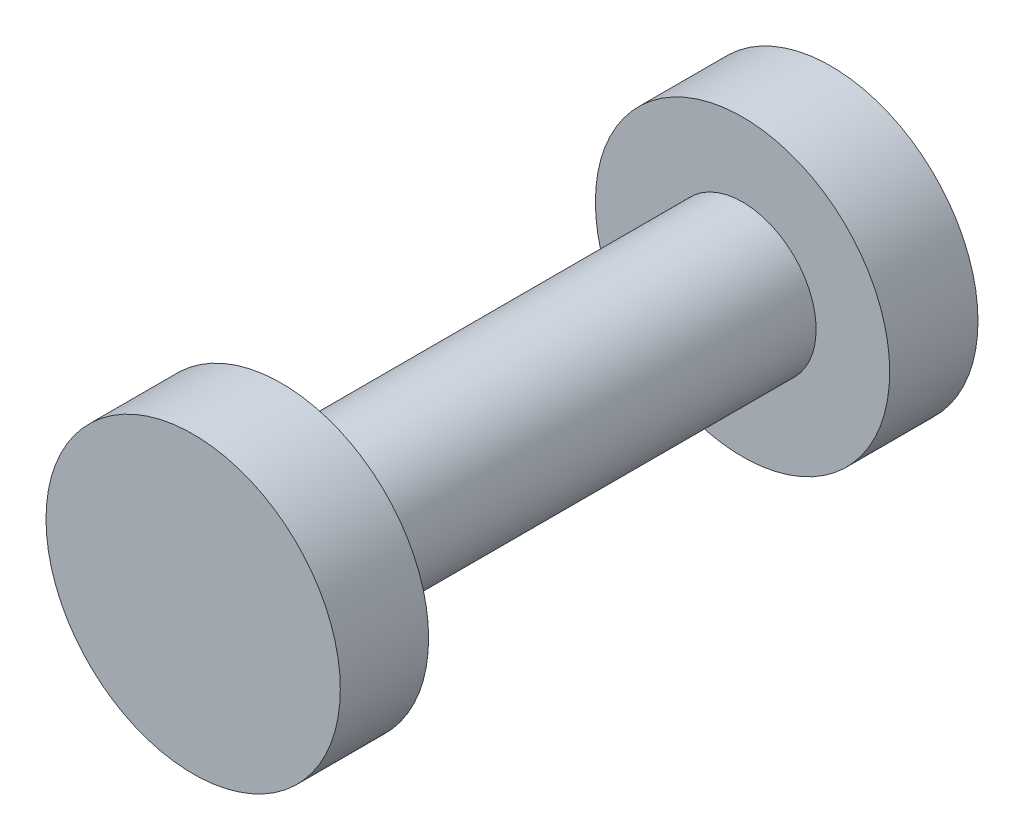
ISO-10303-21;
HEADER;
FILE_DESCRIPTION(('STEP AP214'),'2;1');
FILE_NAME('part.step','',(''),(''),'','','');
FILE_SCHEMA(('AUTOMOTIVE_DESIGN { 1 0 10303 214 1 1 1 1 }'));
ENDSEC;
DATA;
#1=APPLICATION_CONTEXT('core data for automotive mechanical design processes');
#2=APPLICATION_PROTOCOL_DEFINITION('international standard','automotive_design',2000,#1);
#3=PRODUCT_CONTEXT('',#1,'mechanical');
#4=PRODUCT('Part','Part','',(#3));
#5=PRODUCT_RELATED_PRODUCT_CATEGORY('part','',(#4));
#6=PRODUCT_DEFINITION_FORMATION('','',#4);
#7=PRODUCT_DEFINITION_CONTEXT('part definition',#1,'design');
#8=PRODUCT_DEFINITION('design','',#6,#7);
#9=PRODUCT_DEFINITION_SHAPE('','',#8);
#10=(LENGTH_UNIT() NAMED_UNIT(*) SI_UNIT(.MILLI.,.METRE.));
#11=(NAMED_UNIT(*) PLANE_ANGLE_UNIT() SI_UNIT($,.RADIAN.));
#12=(NAMED_UNIT(*) SI_UNIT($,.STERADIAN.) SOLID_ANGLE_UNIT());
#13=UNCERTAINTY_MEASURE_WITH_UNIT(LENGTH_MEASURE(1.E-05),#10,'distance_accuracy_value','');
#14=(GEOMETRIC_REPRESENTATION_CONTEXT(3) GLOBAL_UNCERTAINTY_ASSIGNED_CONTEXT((#13)) GLOBAL_UNIT_ASSIGNED_CONTEXT((#10,
#11,#12)) REPRESENTATION_CONTEXT('',''));
#15=CARTESIAN_POINT('',(0.,0.,0.));
#16=DIRECTION('',(0.,0.,1.));
#17=DIRECTION('',(1.,0.,0.));
#18=AXIS2_PLACEMENT_3D('',#15,#16,#17);
#19=CARTESIAN_POINT('',(0.,0.,6.5));
#20=DIRECTION('',(0.,0.,-1.));
#21=DIRECTION('',(-1.,0.,0.));
#22=AXIS2_PLACEMENT_3D('',#19,#20,#21);
#23=CYLINDRICAL_SURFACE('',#22,1.5);
#24=CARTESIAN_POINT('',(0.,0.,4.7));
#25=DIRECTION('',(0.,0.,1.));
#26=DIRECTION('',(1.,0.,0.));
#27=AXIS2_PLACEMENT_3D('',#24,#25,#26);
#28=CIRCLE('',#27,1.5);
#29=CARTESIAN_POINT('',(1.5,0.,4.7));
#30=VERTEX_POINT('',#29);
#31=EDGE_CURVE('E41',#30,#30,#28,.T.);
#32=ORIENTED_EDGE('',*,*,#31,.F.);
#33=EDGE_LOOP('',(#32));
#34=FACE_BOUND('',#33,.T.);
#35=CARTESIAN_POINT('',(0.,0.,-4.7));
#36=DIRECTION('',(0.,0.,-1.));
#37=DIRECTION('',(-1.,0.,0.));
#38=AXIS2_PLACEMENT_3D('',#35,#36,#37);
#39=CIRCLE('',#38,1.5);
#40=CARTESIAN_POINT('',(-1.5,0.,-4.7));
#41=VERTEX_POINT('',#40);
#42=EDGE_CURVE('E10',#41,#41,#39,.T.);
#43=ORIENTED_EDGE('',*,*,#42,.F.);
#44=EDGE_LOOP('',(#43));
#45=FACE_BOUND('',#44,.T.);
#46=ADVANCED_FACE('F35',(#34,#45),#23,.T.);
#47=CARTESIAN_POINT('',(0.,0.,4.7));
#48=DIRECTION('',(0.,0.,1.));
#49=DIRECTION('',(1.,0.,0.));
#50=AXIS2_PLACEMENT_3D('',#47,#48,#49);
#51=CYLINDRICAL_SURFACE('',#50,3.);
#52=CARTESIAN_POINT('',(0.,0.,4.7));
#53=DIRECTION('',(0.,0.,1.));
#54=DIRECTION('',(1.,0.,0.));
#55=AXIS2_PLACEMENT_3D('',#52,#53,#54);
#56=CIRCLE('',#55,3.);
#57=CARTESIAN_POINT('',(3.,0.,4.7));
#58=VERTEX_POINT('',#57);
#59=EDGE_CURVE('E45',#58,#58,#56,.T.);
#60=ORIENTED_EDGE('',*,*,#59,.T.);
#61=EDGE_LOOP('',(#60));
#62=FACE_BOUND('',#61,.T.);
#63=CARTESIAN_POINT('',(0.,0.,6.5));
#64=DIRECTION('',(0.,0.,1.));
#65=DIRECTION('',(1.,0.,0.));
#66=AXIS2_PLACEMENT_3D('',#63,#64,#65);
#67=CIRCLE('',#66,3.);
#68=CARTESIAN_POINT('',(3.,0.,6.5));
#69=VERTEX_POINT('',#68);
#70=EDGE_CURVE('E49',#69,#69,#67,.T.);
#71=ORIENTED_EDGE('',*,*,#70,.F.);
#72=EDGE_LOOP('',(#71));
#73=FACE_BOUND('',#72,.T.);
#74=ADVANCED_FACE('F78',(#62,#73),#51,.T.);
#75=CARTESIAN_POINT('',(0.,0.,4.7));
#76=DIRECTION('',(0.,0.,1.));
#77=DIRECTION('',(1.,0.,0.));
#78=AXIS2_PLACEMENT_3D('',#75,#76,#77);
#79=PLANE('',#78);
#80=ORIENTED_EDGE('',*,*,#31,.T.);
#81=EDGE_LOOP('',(#80));
#82=FACE_BOUND('',#81,.T.);
#83=ORIENTED_EDGE('',*,*,#59,.F.);
#84=EDGE_LOOP('',(#83));
#85=FACE_BOUND('',#84,.T.);
#86=ADVANCED_FACE('F83',(#82,#85),#79,.F.);
#87=CARTESIAN_POINT('',(0.,0.,6.5));
#88=DIRECTION('',(0.,0.,1.));
#89=DIRECTION('',(1.,0.,0.));
#90=AXIS2_PLACEMENT_3D('',#87,#88,#89);
#91=PLANE('',#90);
#92=ORIENTED_EDGE('',*,*,#70,.T.);
#93=EDGE_LOOP('',(#92));
#94=FACE_BOUND('',#93,.T.);
#95=ADVANCED_FACE('F66',(#94),#91,.T.);
#96=CARTESIAN_POINT('',(0.,0.,-4.7));
#97=DIRECTION('',(0.,0.,-1.));
#98=DIRECTION('',(-1.,0.,0.));
#99=AXIS2_PLACEMENT_3D('',#96,#97,#98);
#100=CYLINDRICAL_SURFACE('',#99,3.);
#101=CARTESIAN_POINT('',(0.,0.,-4.7));
#102=DIRECTION('',(0.,0.,1.));
#103=DIRECTION('',(1.,0.,0.));
#104=AXIS2_PLACEMENT_3D('',#101,#102,#103);
#105=CIRCLE('',#104,3.);
#106=CARTESIAN_POINT('',(3.,0.,-4.7));
#107=VERTEX_POINT('',#106);
#108=EDGE_CURVE('E53',#107,#107,#105,.T.);
#109=ORIENTED_EDGE('',*,*,#108,.F.);
#110=EDGE_LOOP('',(#109));
#111=FACE_BOUND('',#110,.T.);
#112=CARTESIAN_POINT('',(0.,0.,-6.5));
#113=DIRECTION('',(0.,0.,1.));
#114=DIRECTION('',(1.,0.,0.));
#115=AXIS2_PLACEMENT_3D('',#112,#113,#114);
#116=CIRCLE('',#115,3.);
#117=CARTESIAN_POINT('',(3.,0.,-6.5));
#118=VERTEX_POINT('',#117);
#119=EDGE_CURVE('E55',#118,#118,#116,.T.);
#120=ORIENTED_EDGE('',*,*,#119,.T.);
#121=EDGE_LOOP('',(#120));
#122=FACE_BOUND('',#121,.T.);
#123=ADVANCED_FACE('F63',(#111,#122),#100,.T.);
#124=CARTESIAN_POINT('',(0.,0.,-4.7));
#125=DIRECTION('',(0.,0.,-1.));
#126=DIRECTION('',(1.,0.,0.));
#127=AXIS2_PLACEMENT_3D('',#124,#125,#126);
#128=PLANE('',#127);
#129=ORIENTED_EDGE('',*,*,#42,.T.);
#130=EDGE_LOOP('',(#129));
#131=FACE_BOUND('',#130,.T.);
#132=ORIENTED_EDGE('',*,*,#108,.T.);
#133=EDGE_LOOP('',(#132));
#134=FACE_BOUND('',#133,.T.);
#135=ADVANCED_FACE('F61',(#131,#134),#128,.F.);
#136=CARTESIAN_POINT('',(0.,0.,-6.5));
#137=DIRECTION('',(0.,0.,1.));
#138=DIRECTION('',(1.,0.,0.));
#139=AXIS2_PLACEMENT_3D('',#136,#137,#138);
#140=PLANE('',#139);
#141=ORIENTED_EDGE('',*,*,#119,.F.);
#142=EDGE_LOOP('',(#141));
#143=FACE_BOUND('',#142,.T.);
#144=ADVANCED_FACE('F70',(#143),#140,.F.);
#145=CLOSED_SHELL('',(#46,#74,#86,#95,#123,#135,#144));
#146=MANIFOLD_SOLID_BREP('B2',#145);
#147=ADVANCED_BREP_SHAPE_REPRESENTATION('',(#18,#146),#14);
#148=SHAPE_DEFINITION_REPRESENTATION(#9,#147);
ENDSEC;
END-ISO-10303-21;
